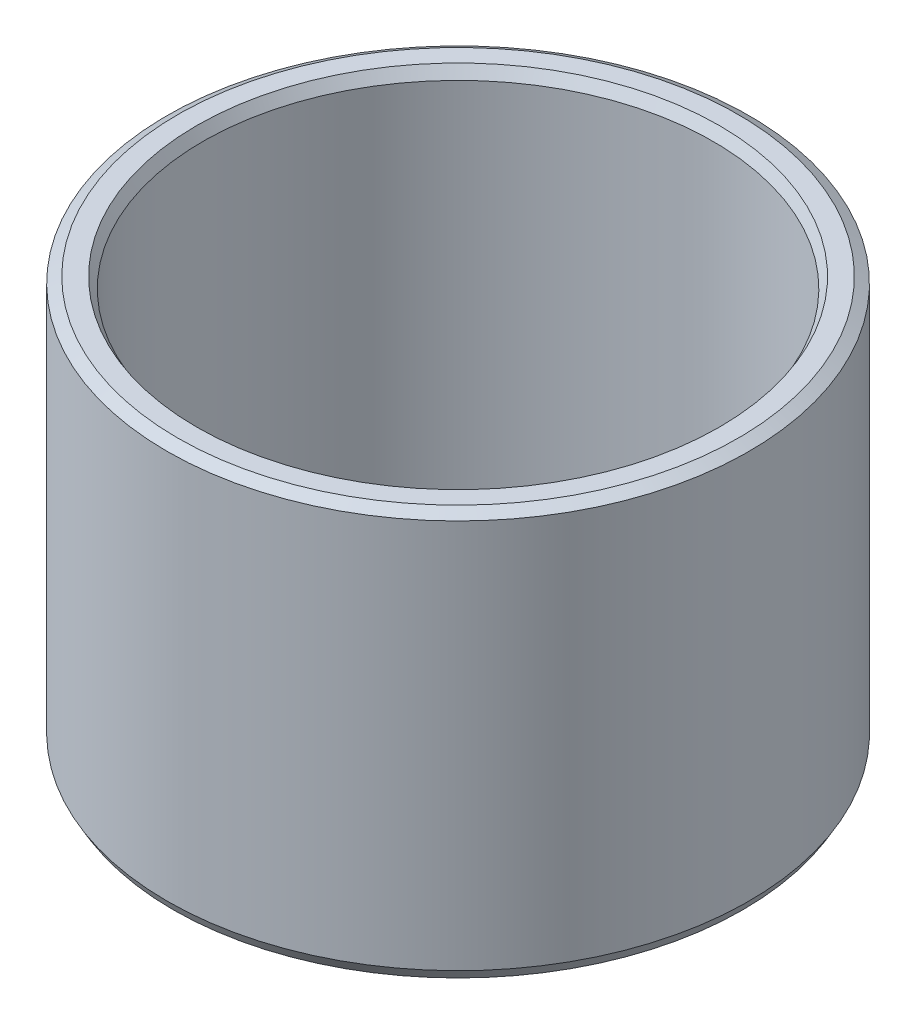
ISO-10303-21;
HEADER;
FILE_DESCRIPTION(('STEP AP214'),'2;1');
FILE_NAME('part.step','',(''),(''),'','','');
FILE_SCHEMA(('AUTOMOTIVE_DESIGN { 1 0 10303 214 1 1 1 1 }'));
ENDSEC;
DATA;
#1=APPLICATION_CONTEXT('core data for automotive mechanical design processes');
#2=APPLICATION_PROTOCOL_DEFINITION('international standard','automotive_design',2000,#1);
#3=PRODUCT_CONTEXT('',#1,'mechanical');
#4=PRODUCT('Part','Part','',(#3));
#5=PRODUCT_RELATED_PRODUCT_CATEGORY('part','',(#4));
#6=PRODUCT_DEFINITION_FORMATION('','',#4);
#7=PRODUCT_DEFINITION_CONTEXT('part definition',#1,'design');
#8=PRODUCT_DEFINITION('design','',#6,#7);
#9=PRODUCT_DEFINITION_SHAPE('','',#8);
#10=(LENGTH_UNIT() NAMED_UNIT(*) SI_UNIT(.MILLI.,.METRE.));
#11=(NAMED_UNIT(*) PLANE_ANGLE_UNIT() SI_UNIT($,.RADIAN.));
#12=(NAMED_UNIT(*) SI_UNIT($,.STERADIAN.) SOLID_ANGLE_UNIT());
#13=UNCERTAINTY_MEASURE_WITH_UNIT(LENGTH_MEASURE(1.E-05),#10,'distance_accuracy_value','');
#14=(GEOMETRIC_REPRESENTATION_CONTEXT(3) GLOBAL_UNCERTAINTY_ASSIGNED_CONTEXT((#13)) GLOBAL_UNIT_ASSIGNED_CONTEXT((#10,
#11,#12)) REPRESENTATION_CONTEXT('',''));
#15=CARTESIAN_POINT('',(0.,0.,0.));
#16=DIRECTION('',(0.,0.,1.));
#17=DIRECTION('',(1.,0.,0.));
#18=AXIS2_PLACEMENT_3D('',#15,#16,#17);
#19=CARTESIAN_POINT('',(0.,73.3216103560459,0.));
#20=DIRECTION('',(0.,-1.,0.));
#21=DIRECTION('',(0.,0.,-1.));
#22=AXIS2_PLACEMENT_3D('',#19,#20,#21);
#23=CYLINDRICAL_SURFACE('',#22,52.5);
#24=CARTESIAN_POINT('',(0.,1.9267123703306,0.));
#25=DIRECTION('',(0.,1.,0.));
#26=DIRECTION('',(0.,0.,1.));
#27=AXIS2_PLACEMENT_3D('',#24,#25,#26);
#28=CIRCLE('',#27,52.5);
#29=CARTESIAN_POINT('',(0.,1.9267123703306,52.5));
#30=VERTEX_POINT('',#29);
#31=EDGE_CURVE('E10',#30,#30,#28,.T.);
#32=ORIENTED_EDGE('',*,*,#31,.T.);
#33=EDGE_LOOP('',(#32));
#34=FACE_BOUND('',#33,.T.);
#35=CARTESIAN_POINT('',(0.,72.2092224503845,0.));
#36=DIRECTION('',(0.,1.,0.));
#37=DIRECTION('',(0.,0.,1.));
#38=AXIS2_PLACEMENT_3D('',#35,#36,#37);
#39=CIRCLE('',#38,52.5);
#40=CARTESIAN_POINT('',(0.,72.2092224503845,52.5));
#41=VERTEX_POINT('',#40);
#42=EDGE_CURVE('E50',#41,#41,#39,.F.);
#43=ORIENTED_EDGE('',*,*,#42,.T.);
#44=EDGE_LOOP('',(#43));
#45=FACE_BOUND('',#44,.T.);
#46=ADVANCED_FACE('F39',(#34,#45),#23,.T.);
#47=CARTESIAN_POINT('',(0.,73.3216103560459,0.));
#48=DIRECTION('',(0.,1.,0.));
#49=DIRECTION('',(0.,0.,1.));
#50=AXIS2_PLACEMENT_3D('',#47,#48,#49);
#51=PLANE('',#50);
#52=CARTESIAN_POINT('',(0.,73.3216103560459,0.));
#53=DIRECTION('',(0.,1.,0.));
#54=DIRECTION('',(0.,0.,1.));
#55=AXIS2_PLACEMENT_3D('',#52,#53,#54);
#56=CIRCLE('',#55,47.1516136182296);
#57=CARTESIAN_POINT('',(0.,73.3216103560459,47.1516136182296));
#58=VERTEX_POINT('',#57);
#59=EDGE_CURVE('E58',#58,#58,#56,.F.);
#60=ORIENTED_EDGE('',*,*,#59,.T.);
#61=EDGE_LOOP('',(#60));
#62=FACE_BOUND('',#61,.T.);
#63=CARTESIAN_POINT('',(0.,73.3216103560459,0.));
#64=DIRECTION('',(0.,1.,0.));
#65=DIRECTION('',(0.,0.,1.));
#66=AXIS2_PLACEMENT_3D('',#63,#64,#65);
#67=CIRCLE('',#66,50.5732876296693);
#68=CARTESIAN_POINT('',(0.,73.3216103560459,50.5732876296693));
#69=VERTEX_POINT('',#68);
#70=EDGE_CURVE('E61',#69,#69,#67,.T.);
#71=ORIENTED_EDGE('',*,*,#70,.T.);
#72=EDGE_LOOP('',(#71));
#73=FACE_BOUND('',#72,.T.);
#74=ADVANCED_FACE('F88',(#62,#73),#51,.T.);
#75=CARTESIAN_POINT('',(0.,0.,0.));
#76=DIRECTION('',(0.,1.,0.));
#77=DIRECTION('',(0.,0.,1.));
#78=AXIS2_PLACEMENT_3D('',#75,#76,#77);
#79=PLANE('',#78);
#80=CARTESIAN_POINT('',(0.,0.,0.));
#81=DIRECTION('',(0.,1.,0.));
#82=DIRECTION('',(0.,0.,1.));
#83=AXIS2_PLACEMENT_3D('',#80,#81,#82);
#84=CIRCLE('',#83,47.9659380828988);
#85=CARTESIAN_POINT('',(0.,0.,47.9659380828988));
#86=VERTEX_POINT('',#85);
#87=EDGE_CURVE('E51',#86,#86,#84,.T.);
#88=ORIENTED_EDGE('',*,*,#87,.T.);
#89=EDGE_LOOP('',(#88));
#90=FACE_BOUND('',#89,.T.);
#91=CARTESIAN_POINT('',(0.,0.,0.));
#92=DIRECTION('',(0.,1.,0.));
#93=DIRECTION('',(0.,0.,1.));
#94=AXIS2_PLACEMENT_3D('',#91,#92,#93);
#95=CIRCLE('',#94,51.3876120943386);
#96=CARTESIAN_POINT('',(0.,0.,51.3876120943386));
#97=VERTEX_POINT('',#96);
#98=EDGE_CURVE('E54',#97,#97,#95,.F.);
#99=ORIENTED_EDGE('',*,*,#98,.T.);
#100=EDGE_LOOP('',(#99));
#101=FACE_BOUND('',#100,.T.);
#102=ADVANCED_FACE('F83',(#90,#101),#79,.F.);
#103=CARTESIAN_POINT('',(0.,73.3216103560459,0.));
#104=DIRECTION('',(0.,-1.,0.));
#105=DIRECTION('',(0.,0.,-1.));
#106=AXIS2_PLACEMENT_3D('',#103,#104,#105);
#107=CYLINDRICAL_SURFACE('',#106,46.0392257125682);
#108=CARTESIAN_POINT('',(0.,71.3948979857153,0.));
#109=DIRECTION('',(0.,1.,0.));
#110=DIRECTION('',(0.,0.,1.));
#111=AXIS2_PLACEMENT_3D('',#108,#109,#110);
#112=CIRCLE('',#111,46.0392257125682);
#113=CARTESIAN_POINT('',(0.,71.3948979857153,46.0392257125682));
#114=VERTEX_POINT('',#113);
#115=EDGE_CURVE('E67',#114,#114,#112,.T.);
#116=ORIENTED_EDGE('',*,*,#115,.T.);
#117=EDGE_LOOP('',(#116));
#118=FACE_BOUND('',#117,.T.);
#119=CARTESIAN_POINT('',(0.,1.11238790566139,0.));
#120=DIRECTION('',(0.,1.,0.));
#121=DIRECTION('',(0.,0.,1.));
#122=AXIS2_PLACEMENT_3D('',#119,#120,#121);
#123=CIRCLE('',#122,46.0392257125682);
#124=CARTESIAN_POINT('',(0.,1.11238790566139,46.0392257125682));
#125=VERTEX_POINT('',#124);
#126=EDGE_CURVE('E69',#125,#125,#123,.F.);
#127=ORIENTED_EDGE('',*,*,#126,.T.);
#128=EDGE_LOOP('',(#127));
#129=FACE_BOUND('',#128,.T.);
#130=ADVANCED_FACE('F71',(#118,#129),#107,.F.);
#131=CARTESIAN_POINT('',(0.,71.3948979857153,0.));
#132=DIRECTION('',(0.,1.,0.));
#133=DIRECTION('',(0.,0.,1.));
#134=AXIS2_PLACEMENT_3D('',#131,#132,#133);
#135=CONICAL_SURFACE('',#134,46.0392257125682,0.523598775598302);
#136=ORIENTED_EDGE('',*,*,#59,.F.);
#137=EDGE_LOOP('',(#136));
#138=FACE_BOUND('',#137,.T.);
#139=ORIENTED_EDGE('',*,*,#115,.F.);
#140=EDGE_LOOP('',(#139));
#141=FACE_BOUND('',#140,.T.);
#142=ADVANCED_FACE('F77',(#138,#141),#135,.F.);
#143=CARTESIAN_POINT('',(0.,0.,0.));
#144=DIRECTION('',(0.,-1.,0.));
#145=DIRECTION('',(0.,0.,-1.));
#146=AXIS2_PLACEMENT_3D('',#143,#144,#145);
#147=CONICAL_SURFACE('',#146,47.9659380828988,1.04719755119659);
#148=ORIENTED_EDGE('',*,*,#126,.F.);
#149=EDGE_LOOP('',(#148));
#150=FACE_BOUND('',#149,.T.);
#151=ORIENTED_EDGE('',*,*,#87,.F.);
#152=EDGE_LOOP('',(#151));
#153=FACE_BOUND('',#152,.T.);
#154=ADVANCED_FACE('F73',(#150,#153),#147,.F.);
#155=CARTESIAN_POINT('',(0.,1.9267123703306,0.));
#156=DIRECTION('',(0.,1.,0.));
#157=DIRECTION('',(0.,0.,1.));
#158=AXIS2_PLACEMENT_3D('',#155,#156,#157);
#159=CONICAL_SURFACE('',#158,52.5,0.523598775598298);
#160=CARTESIAN_POINT('',(0.,0.,51.3876120943386));
#161=CARTESIAN_POINT('',(0.,0.0200699205242769,51.399199468356));
#162=CARTESIAN_POINT('',(0.,0.0401398410485539,51.4107868423733));
#163=CARTESIAN_POINT('',(0.,0.080279682097108,51.4339615904079));
#164=CARTESIAN_POINT('',(0.,0.100349602621385,51.4455489644252));
#165=CARTESIAN_POINT('',(0.,0.140489443669939,51.4687237124598));
#166=CARTESIAN_POINT('',(0.,0.160559364194216,51.4803110864771));
#167=CARTESIAN_POINT('',(0.,0.20069920524277,51.5034858345117));
#168=CARTESIAN_POINT('',(0.,0.220769125767047,51.515073208529));
#169=CARTESIAN_POINT('',(0.,0.260908966815601,51.5382479565636));
#170=CARTESIAN_POINT('',(0.,0.280978887339879,51.5498353305809));
#171=CARTESIAN_POINT('',(0.,0.321118728388433,51.5730100786155));
#172=CARTESIAN_POINT('',(0.,0.34118864891271,51.5845974526328));
#173=CARTESIAN_POINT('',(0.,0.381328489961264,51.6077722006674));
#174=CARTESIAN_POINT('',(0.,0.401398410485541,51.6193595746848));
#175=CARTESIAN_POINT('',(0.,0.441538251534095,51.6425343227194));
#176=CARTESIAN_POINT('',(0.,0.461608172058372,51.6541216967367));
#177=CARTESIAN_POINT('',(0.,0.501748013106926,51.6772964447713));
#178=CARTESIAN_POINT('',(0.,0.521817933631203,51.6888838187886));
#179=CARTESIAN_POINT('',(0.,0.561957774679757,51.7120585668232));
#180=CARTESIAN_POINT('',(0.,0.582027695204034,51.7236459408405));
#181=CARTESIAN_POINT('',(0.,0.622167536252588,51.7468206888751));
#182=CARTESIAN_POINT('',(0.,0.642237456776865,51.7584080628924));
#183=CARTESIAN_POINT('',(0.,0.682377297825419,51.781582810927));
#184=CARTESIAN_POINT('',(0.,0.702447218349697,51.7931701849444));
#185=CARTESIAN_POINT('',(0.,0.742587059398251,51.816344932979));
#186=CARTESIAN_POINT('',(0.,0.762656979922528,51.8279323069963));
#187=CARTESIAN_POINT('',(0.,0.802796820971082,51.8511070550309));
#188=CARTESIAN_POINT('',(0.,0.822866741495359,51.8626944290482));
#189=CARTESIAN_POINT('',(0.,0.863006582543913,51.8858691770828));
#190=CARTESIAN_POINT('',(0.,0.88307650306819,51.8974565511001));
#191=CARTESIAN_POINT('',(0.,0.923216344116744,51.9206312991347));
#192=CARTESIAN_POINT('',(0.,0.943286264641021,51.932218673152));
#193=CARTESIAN_POINT('',(0.,0.983426105689576,51.9553934211866));
#194=CARTESIAN_POINT('',(0.,1.00349602621385,51.9669807952039));
#195=CARTESIAN_POINT('',(0.,1.04363586726241,51.9901555432385));
#196=CARTESIAN_POINT('',(0.,1.06370578778668,52.0017429172559));
#197=CARTESIAN_POINT('',(0.,1.10384562883524,52.0249176652905));
#198=CARTESIAN_POINT('',(0.,1.12391554935951,52.0365050393078));
#199=CARTESIAN_POINT('',(0.,1.16405539040807,52.0596797873424));
#200=CARTESIAN_POINT('',(0.,1.18412531093235,52.0712671613597));
#201=CARTESIAN_POINT('',(0.,1.2242651519809,52.0944419093943));
#202=CARTESIAN_POINT('',(0.,1.24433507250518,52.1060292834116));
#203=CARTESIAN_POINT('',(0.,1.28447491355373,52.1292040314462));
#204=CARTESIAN_POINT('',(0.,1.30454483407801,52.1407914054635));
#205=CARTESIAN_POINT('',(0.,1.34468467512656,52.1639661534981));
#206=CARTESIAN_POINT('',(0.,1.36475459565084,52.1755535275154));
#207=CARTESIAN_POINT('',(0.,1.40489443669939,52.19872827555));
#208=CARTESIAN_POINT('',(0.,1.42496435722367,52.2103156495674));
#209=CARTESIAN_POINT('',(0.,1.46510419827222,52.233490397602));
#210=CARTESIAN_POINT('',(0.,1.4851741187965,52.2450777716193));
#211=CARTESIAN_POINT('',(0.,1.52531395984506,52.2682525196539));
#212=CARTESIAN_POINT('',(0.,1.54538388036933,52.2798398936712));
#213=CARTESIAN_POINT('',(0.,1.58552372141789,52.3030146417058));
#214=CARTESIAN_POINT('',(0.,1.60559364194216,52.3146020157231));
#215=CARTESIAN_POINT('',(0.,1.64573348299072,52.3377767637577));
#216=CARTESIAN_POINT('',(0.,1.665803403515,52.349364137775));
#217=CARTESIAN_POINT('',(0.,1.70594324456355,52.3725388858096));
#218=CARTESIAN_POINT('',(0.,1.72601316508783,52.3841262598269));
#219=CARTESIAN_POINT('',(0.,1.76615300613638,52.4073010078615));
#220=CARTESIAN_POINT('',(0.,1.78622292666066,52.4188883818789));
#221=CARTESIAN_POINT('',(0.,1.82636276770921,52.4420631299135));
#222=CARTESIAN_POINT('',(0.,1.84643268823349,52.4536505039308));
#223=CARTESIAN_POINT('',(0.,1.88657252928204,52.4768252519654));
#224=CARTESIAN_POINT('',(0.,1.90664244980632,52.4884126259827));
#225=CARTESIAN_POINT('',(0.,1.9267123703306,52.5));
#226=B_SPLINE_CURVE_WITH_KNOTS('',3,(#160,#161,#162,#163,#164,#165,#166,#167,#168,#169,#170,
#171,#172,#173,#174,#175,#176,#177,#178,#179,#180,#181,#182,#183,#184,#185,#186,#187,#188,#189,
#190,#191,#192,#193,#194,#195,#196,#197,#198,#199,#200,#201,#202,#203,#204,#205,#206,#207,#208,
#209,#210,#211,#212,#213,#214,#215,#216,#217,#218,#219,#220,#221,#222,#223,#224,#225),
.UNSPECIFIED.,.F.,.F.,(4,2,2,2,2,2,2,2,2,2,2,2,2,2,2,2,2,2,2,2,2,2,2,2,2,2,2,2,2,2,2,2,4),(0.,
0.0695242441038348,0.13904848820767,0.208572732311504,0.278096976415339,0.347621220519171,
0.417145464623005,0.48666970872684,0.556193952830675,0.62571819693451,0.695242441038344,
0.764766685142179,0.834290929246014,0.903815173349849,0.973339417453684,1.04286366155752,
1.11238790566135,1.18191214976518,1.25143639386902,1.32096063797285,1.39048488207669,
1.46000912618052,1.52953337028436,1.59905761438819,1.66858185849203,1.73810610259586,
1.8076303466997,1.87715459080353,1.94667883490736,2.0162030790112,2.08572732311503,
2.15525156721887,2.2247758113227),.UNSPECIFIED.);
#227=EDGE_CURVE('BSEAM76',#97,#30,#226,.T.);
#228=ORIENTED_EDGE('',*,*,#98,.F.);
#229=ORIENTED_EDGE('',*,*,#31,.F.);
#230=ORIENTED_EDGE('',*,*,#227,.T.);
#231=ORIENTED_EDGE('',*,*,#227,.F.);
#232=EDGE_LOOP('',(#228,#230,#229,#231));
#233=FACE_BOUND('',#232,.T.);
#234=ADVANCED_FACE('F76',(#233),#159,.T.);
#235=CARTESIAN_POINT('',(0.,73.3216103560459,0.));
#236=DIRECTION('',(0.,-1.,0.));
#237=DIRECTION('',(0.,0.,-1.));
#238=AXIS2_PLACEMENT_3D('',#235,#236,#237);
#239=CONICAL_SURFACE('',#238,50.5732876296693,1.0471975511966);
#240=ORIENTED_EDGE('',*,*,#42,.F.);
#241=EDGE_LOOP('',(#240));
#242=FACE_BOUND('',#241,.T.);
#243=ORIENTED_EDGE('',*,*,#70,.F.);
#244=EDGE_LOOP('',(#243));
#245=FACE_BOUND('',#244,.T.);
#246=ADVANCED_FACE('F45',(#242,#245),#239,.T.);
#247=CLOSED_SHELL('',(#46,#74,#102,#130,#142,#154,#234,#246));
#248=MANIFOLD_SOLID_BREP('B2',#247);
#249=ADVANCED_BREP_SHAPE_REPRESENTATION('',(#18,#248),#14);
#250=SHAPE_DEFINITION_REPRESENTATION(#9,#249);
ENDSEC;
END-ISO-10303-21;
